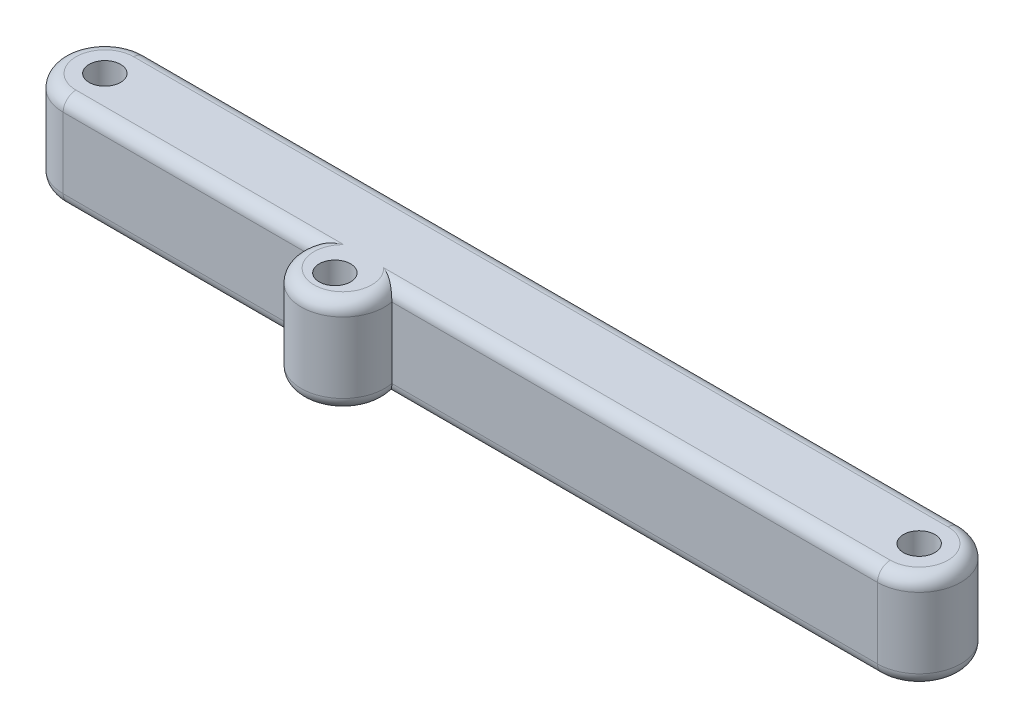
ISO-10303-21;
HEADER;
FILE_DESCRIPTION(('STEP AP214'),'2;1');
FILE_NAME('part.step','',(''),(''),'','','');
FILE_SCHEMA(('AUTOMOTIVE_DESIGN { 1 0 10303 214 1 1 1 1 }'));
ENDSEC;
DATA;
#1=APPLICATION_CONTEXT('core data for automotive mechanical design processes');
#2=APPLICATION_PROTOCOL_DEFINITION('international standard','automotive_design',2000,#1);
#3=PRODUCT_CONTEXT('',#1,'mechanical');
#4=PRODUCT('Part','Part','',(#3));
#5=PRODUCT_RELATED_PRODUCT_CATEGORY('part','',(#4));
#6=PRODUCT_DEFINITION_FORMATION('','',#4);
#7=PRODUCT_DEFINITION_CONTEXT('part definition',#1,'design');
#8=PRODUCT_DEFINITION('design','',#6,#7);
#9=PRODUCT_DEFINITION_SHAPE('','',#8);
#10=(LENGTH_UNIT() NAMED_UNIT(*) SI_UNIT(.MILLI.,.METRE.));
#11=(NAMED_UNIT(*) PLANE_ANGLE_UNIT() SI_UNIT($,.RADIAN.));
#12=(NAMED_UNIT(*) SI_UNIT($,.STERADIAN.) SOLID_ANGLE_UNIT());
#13=UNCERTAINTY_MEASURE_WITH_UNIT(LENGTH_MEASURE(1.E-05),#10,'distance_accuracy_value','');
#14=(GEOMETRIC_REPRESENTATION_CONTEXT(3) GLOBAL_UNCERTAINTY_ASSIGNED_CONTEXT((#13)) GLOBAL_UNIT_ASSIGNED_CONTEXT((#10,
#11,#12)) REPRESENTATION_CONTEXT('',''));
#15=CARTESIAN_POINT('',(0.,0.,0.));
#16=DIRECTION('',(0.,0.,1.));
#17=DIRECTION('',(1.,0.,0.));
#18=AXIS2_PLACEMENT_3D('',#15,#16,#17);
#19=CARTESIAN_POINT('',(-80.645,19.05,8.255));
#20=DIRECTION('',(0.,0.,-1.));
#21=DIRECTION('',(-1.,0.,0.));
#22=AXIS2_PLACEMENT_3D('',#19,#20,#21);
#23=PLANE('',#22);
#24=DIRECTION('',(0.,-1.,0.));
#25=VECTOR('',#24,1.);
#26=CARTESIAN_POINT('',(-80.645,19.05,8.255));
#27=LINE('',#26,#25);
#28=CARTESIAN_POINT('',(-80.645,16.51,8.255));
#29=VERTEX_POINT('',#28);
#30=CARTESIAN_POINT('',(-80.645,2.54,8.255));
#31=VERTEX_POINT('',#30);
#32=EDGE_CURVE('E171',#29,#31,#27,.T.);
#33=ORIENTED_EDGE('',*,*,#32,.T.);
#34=DIRECTION('',(1.,0.,0.));
#35=VECTOR('',#34,1.);
#36=CARTESIAN_POINT('',(-80.645,2.54,8.255));
#37=LINE('',#36,#35);
#38=CARTESIAN_POINT('',(-31.7511480940799,2.54,8.255));
#39=VERTEX_POINT('',#38);
#40=EDGE_CURVE('E189',#31,#39,#37,.T.);
#41=ORIENTED_EDGE('',*,*,#40,.T.);
#42=DIRECTION('',(0.,1.,0.));
#43=VECTOR('',#42,1.);
#44=CARTESIAN_POINT('',(-31.7511480940799,-19.2212098019349,8.255));
#45=LINE('',#44,#43);
#46=CARTESIAN_POINT('',(-31.7511480940799,16.51,8.255));
#47=VERTEX_POINT('',#46);
#48=EDGE_CURVE('E136',#39,#47,#45,.T.);
#49=ORIENTED_EDGE('',*,*,#48,.T.);
#50=DIRECTION('',(1.,0.,0.));
#51=VECTOR('',#50,1.);
#52=CARTESIAN_POINT('',(-80.645,16.51,8.255));
#53=LINE('',#52,#51);
#54=EDGE_CURVE('E187',#47,#29,#53,.F.);
#55=ORIENTED_EDGE('',*,*,#54,.T.);
#56=EDGE_LOOP('',(#33,#41,#49,#55));
#57=FACE_BOUND('',#56,.T.);
#58=ADVANCED_FACE('F37',(#57),#23,.F.);
#59=CARTESIAN_POINT('',(-80.645,19.05,0.));
#60=DIRECTION('',(0.,1.,0.));
#61=DIRECTION('',(0.,0.,1.));
#62=AXIS2_PLACEMENT_3D('',#59,#60,#61);
#63=PLANE('',#62);
#64=DIRECTION('',(1.,0.,0.));
#65=VECTOR('',#64,1.);
#66=CARTESIAN_POINT('',(-31.7511480940799,19.05,5.715));
#67=LINE('',#66,#65);
#68=CARTESIAN_POINT('',(-80.645,19.05,5.715));
#69=VERTEX_POINT('',#68);
#70=CARTESIAN_POINT('',(-27.6030734443614,19.05,5.715));
#71=VERTEX_POINT('',#70);
#72=EDGE_CURVE('E199',#69,#71,#67,.T.);
#73=ORIENTED_EDGE('',*,*,#72,.T.);
#74=CARTESIAN_POINT('',(-23.650230322,19.05,9.8425));
#75=DIRECTION('',(0.,1.,0.));
#76=DIRECTION('',(0.,0.,1.));
#77=AXIS2_PLACEMENT_3D('',#74,#75,#76);
#78=CIRCLE('',#77,5.715);
#79=CARTESIAN_POINT('',(-19.6973871996386,19.05,5.715));
#80=VERTEX_POINT('',#79);
#81=EDGE_CURVE('E54',#71,#80,#78,.T.);
#82=ORIENTED_EDGE('',*,*,#81,.T.);
#83=DIRECTION('',(1.,0.,0.));
#84=VECTOR('',#83,1.);
#85=CARTESIAN_POINT('',(80.645,19.05,5.715));
#86=LINE('',#85,#84);
#87=CARTESIAN_POINT('',(80.645,19.05,5.715));
#88=VERTEX_POINT('',#87);
#89=EDGE_CURVE('E203',#80,#88,#86,.T.);
#90=ORIENTED_EDGE('',*,*,#89,.T.);
#91=CARTESIAN_POINT('',(80.645,19.05,0.));
#92=DIRECTION('',(0.,1.,0.));
#93=DIRECTION('',(0.,0.,1.));
#94=AXIS2_PLACEMENT_3D('',#91,#92,#93);
#95=CIRCLE('',#94,5.715);
#96=CARTESIAN_POINT('',(80.645,19.05,-5.715));
#97=VERTEX_POINT('',#96);
#98=EDGE_CURVE('E201',#88,#97,#95,.T.);
#99=ORIENTED_EDGE('',*,*,#98,.T.);
#100=DIRECTION('',(-1.,0.,0.));
#101=VECTOR('',#100,1.);
#102=CARTESIAN_POINT('',(-80.645,19.05,-5.715));
#103=LINE('',#102,#101);
#104=CARTESIAN_POINT('',(-80.645,19.05,-5.715));
#105=VERTEX_POINT('',#104);
#106=EDGE_CURVE('E195',#97,#105,#103,.T.);
#107=ORIENTED_EDGE('',*,*,#106,.T.);
#108=CARTESIAN_POINT('',(-80.645,19.05,0.));
#109=DIRECTION('',(0.,1.,0.));
#110=DIRECTION('',(0.,0.,1.));
#111=AXIS2_PLACEMENT_3D('',#108,#109,#110);
#112=CIRCLE('',#111,5.715);
#113=EDGE_CURVE('E197',#105,#69,#112,.T.);
#114=ORIENTED_EDGE('',*,*,#113,.T.);
#115=EDGE_LOOP('',(#73,#82,#90,#99,#107,#114));
#116=FACE_BOUND('',#115,.T.);
#117=CARTESIAN_POINT('',(-80.645,19.05,0.));
#118=DIRECTION('',(0.,1.,0.));
#119=DIRECTION('',(0.,0.,1.));
#120=AXIS2_PLACEMENT_3D('',#117,#118,#119);
#121=CIRCLE('',#120,3.1115);
#122=CARTESIAN_POINT('',(-80.645,19.05,3.1115));
#123=VERTEX_POINT('',#122);
#124=EDGE_CURVE('E319',#123,#123,#121,.T.);
#125=ORIENTED_EDGE('',*,*,#124,.F.);
#126=EDGE_LOOP('',(#125));
#127=FACE_BOUND('',#126,.T.);
#128=CARTESIAN_POINT('',(80.645,19.05,0.));
#129=DIRECTION('',(0.,1.,0.));
#130=DIRECTION('',(0.,0.,1.));
#131=AXIS2_PLACEMENT_3D('',#128,#129,#130);
#132=CIRCLE('',#131,3.1115);
#133=CARTESIAN_POINT('',(80.645,19.05,3.1115));
#134=VERTEX_POINT('',#133);
#135=EDGE_CURVE('E343',#134,#134,#132,.T.);
#136=ORIENTED_EDGE('',*,*,#135,.F.);
#137=EDGE_LOOP('',(#136));
#138=FACE_BOUND('',#137,.T.);
#139=CARTESIAN_POINT('',(-23.650230322,19.05,11.43));
#140=DIRECTION('',(0.,1.,0.));
#141=DIRECTION('',(0.,0.,1.));
#142=AXIS2_PLACEMENT_3D('',#139,#140,#141);
#143=CIRCLE('',#142,3.1115);
#144=CARTESIAN_POINT('',(-23.650230322,19.05,14.5415));
#145=VERTEX_POINT('',#144);
#146=EDGE_CURVE('E152',#145,#145,#143,.T.);
#147=ORIENTED_EDGE('',*,*,#146,.F.);
#148=EDGE_LOOP('',(#147));
#149=FACE_BOUND('',#148,.T.);
#150=ADVANCED_FACE('F284',(#116,#127,#138,#149),#63,.T.);
#151=CARTESIAN_POINT('',(-80.645,0.,0.));
#152=DIRECTION('',(0.,1.,0.));
#153=DIRECTION('',(0.,0.,1.));
#154=AXIS2_PLACEMENT_3D('',#151,#152,#153);
#155=PLANE('',#154);
#156=DIRECTION('',(1.,0.,0.));
#157=VECTOR('',#156,1.);
#158=CARTESIAN_POINT('',(-80.645,0.,5.715));
#159=LINE('',#158,#157);
#160=CARTESIAN_POINT('',(80.645,0.,5.715));
#161=VERTEX_POINT('',#160);
#162=CARTESIAN_POINT('',(-19.6973871996386,0.,5.715));
#163=VERTEX_POINT('',#162);
#164=EDGE_CURVE('E180',#161,#163,#159,.F.);
#165=ORIENTED_EDGE('',*,*,#164,.T.);
#166=CARTESIAN_POINT('',(-23.650230322,0.,9.8425));
#167=DIRECTION('',(0.,1.,0.));
#168=DIRECTION('',(0.,0.,1.));
#169=AXIS2_PLACEMENT_3D('',#166,#167,#168);
#170=CIRCLE('',#169,5.715);
#171=CARTESIAN_POINT('',(-27.6030734443614,0.,5.715));
#172=VERTEX_POINT('',#171);
#173=EDGE_CURVE('E157',#163,#172,#170,.F.);
#174=ORIENTED_EDGE('',*,*,#173,.T.);
#175=DIRECTION('',(1.,0.,0.));
#176=VECTOR('',#175,1.);
#177=CARTESIAN_POINT('',(-80.645,0.,5.715));
#178=LINE('',#177,#176);
#179=CARTESIAN_POINT('',(-80.645,0.,5.715));
#180=VERTEX_POINT('',#179);
#181=EDGE_CURVE('E176',#172,#180,#178,.F.);
#182=ORIENTED_EDGE('',*,*,#181,.T.);
#183=CARTESIAN_POINT('',(-80.645,0.,0.));
#184=DIRECTION('',(0.,1.,0.));
#185=DIRECTION('',(0.,0.,1.));
#186=AXIS2_PLACEMENT_3D('',#183,#184,#185);
#187=CIRCLE('',#186,5.715);
#188=CARTESIAN_POINT('',(-80.645,0.,-5.715));
#189=VERTEX_POINT('',#188);
#190=EDGE_CURVE('E169',#180,#189,#187,.F.);
#191=ORIENTED_EDGE('',*,*,#190,.T.);
#192=DIRECTION('',(-1.,0.,0.));
#193=VECTOR('',#192,1.);
#194=CARTESIAN_POINT('',(-80.645,0.,-5.715));
#195=LINE('',#194,#193);
#196=CARTESIAN_POINT('',(80.645,0.,-5.715));
#197=VERTEX_POINT('',#196);
#198=EDGE_CURVE('E167',#189,#197,#195,.F.);
#199=ORIENTED_EDGE('',*,*,#198,.T.);
#200=CARTESIAN_POINT('',(80.645,0.,0.));
#201=DIRECTION('',(0.,1.,0.));
#202=DIRECTION('',(0.,0.,1.));
#203=AXIS2_PLACEMENT_3D('',#200,#201,#202);
#204=CIRCLE('',#203,5.715);
#205=EDGE_CURVE('E178',#197,#161,#204,.F.);
#206=ORIENTED_EDGE('',*,*,#205,.T.);
#207=EDGE_LOOP('',(#165,#174,#182,#191,#199,#206));
#208=FACE_BOUND('',#207,.T.);
#209=CARTESIAN_POINT('',(-80.645,0.,0.));
#210=DIRECTION('',(0.,1.,0.));
#211=DIRECTION('',(0.,0.,1.));
#212=AXIS2_PLACEMENT_3D('',#209,#210,#211);
#213=CIRCLE('',#212,3.1115);
#214=CARTESIAN_POINT('',(-80.645,0.,3.1115));
#215=VERTEX_POINT('',#214);
#216=EDGE_CURVE('E340',#215,#215,#213,.T.);
#217=ORIENTED_EDGE('',*,*,#216,.T.);
#218=EDGE_LOOP('',(#217));
#219=FACE_BOUND('',#218,.T.);
#220=CARTESIAN_POINT('',(80.645,0.,0.));
#221=DIRECTION('',(0.,1.,0.));
#222=DIRECTION('',(0.,0.,1.));
#223=AXIS2_PLACEMENT_3D('',#220,#221,#222);
#224=CIRCLE('',#223,3.1115);
#225=CARTESIAN_POINT('',(80.645,0.,3.1115));
#226=VERTEX_POINT('',#225);
#227=EDGE_CURVE('E346',#226,#226,#224,.T.);
#228=ORIENTED_EDGE('',*,*,#227,.T.);
#229=EDGE_LOOP('',(#228));
#230=FACE_BOUND('',#229,.T.);
#231=CARTESIAN_POINT('',(-23.650230322,0.,11.43));
#232=DIRECTION('',(0.,1.,0.));
#233=DIRECTION('',(0.,0.,1.));
#234=AXIS2_PLACEMENT_3D('',#231,#232,#233);
#235=CIRCLE('',#234,3.1115);
#236=CARTESIAN_POINT('',(-23.650230322,0.,14.5415));
#237=VERTEX_POINT('',#236);
#238=EDGE_CURVE('E349',#237,#237,#235,.F.);
#239=ORIENTED_EDGE('',*,*,#238,.F.);
#240=EDGE_LOOP('',(#239));
#241=FACE_BOUND('',#240,.T.);
#242=ADVANCED_FACE('F291',(#208,#219,#230,#241),#155,.F.);
#243=CARTESIAN_POINT('',(-80.645,19.05,0.));
#244=DIRECTION('',(0.,-1.,0.));
#245=DIRECTION('',(0.,0.,-1.));
#246=AXIS2_PLACEMENT_3D('',#243,#244,#245);
#247=CYLINDRICAL_SURFACE('',#246,8.255);
#248=DIRECTION('',(0.,-1.,0.));
#249=VECTOR('',#248,1.);
#250=CARTESIAN_POINT('',(-80.645,19.05,-8.255));
#251=LINE('',#250,#249);
#252=CARTESIAN_POINT('',(-80.645,16.51,-8.255));
#253=VERTEX_POINT('',#252);
#254=CARTESIAN_POINT('',(-80.645,2.54000000000001,-8.255));
#255=VERTEX_POINT('',#254);
#256=EDGE_CURVE('E312',#253,#255,#251,.T.);
#257=ORIENTED_EDGE('',*,*,#256,.T.);
#258=CARTESIAN_POINT('',(-80.645,2.54,0.));
#259=DIRECTION('',(0.,1.,0.));
#260=DIRECTION('',(0.,0.,1.));
#261=AXIS2_PLACEMENT_3D('',#258,#259,#260);
#262=CIRCLE('',#261,8.255);
#263=EDGE_CURVE('E193',#255,#31,#262,.T.);
#264=ORIENTED_EDGE('',*,*,#263,.T.);
#265=ORIENTED_EDGE('',*,*,#32,.F.);
#266=CARTESIAN_POINT('',(-80.645,16.51,0.));
#267=DIRECTION('',(0.,1.,0.));
#268=DIRECTION('',(0.,0.,1.));
#269=AXIS2_PLACEMENT_3D('',#266,#267,#268);
#270=CIRCLE('',#269,8.255);
#271=EDGE_CURVE('E191',#29,#253,#270,.F.);
#272=ORIENTED_EDGE('',*,*,#271,.T.);
#273=EDGE_LOOP('',(#257,#264,#265,#272));
#274=FACE_BOUND('',#273,.T.);
#275=ADVANCED_FACE('F297',(#274),#247,.T.);
#276=DIRECTION('',(0.,1.,0.));
#277=VECTOR('',#276,1.);
#278=CARTESIAN_POINT('',(-15.5493125499201,-19.2212098019349,8.255));
#279=LINE('',#278,#277);
#280=CARTESIAN_POINT('',(-15.5493125499201,2.54,8.255));
#281=VERTEX_POINT('',#280);
#282=CARTESIAN_POINT('',(-15.5493125499201,16.51,8.255));
#283=VERTEX_POINT('',#282);
#284=EDGE_CURVE('E134',#281,#283,#279,.T.);
#285=ORIENTED_EDGE('',*,*,#284,.F.);
#286=DIRECTION('',(1.,0.,0.));
#287=VECTOR('',#286,1.);
#288=CARTESIAN_POINT('',(-80.645,2.54,8.255));
#289=LINE('',#288,#287);
#290=CARTESIAN_POINT('',(80.645,2.54,8.255));
#291=VERTEX_POINT('',#290);
#292=EDGE_CURVE('E149',#281,#291,#289,.T.);
#293=ORIENTED_EDGE('',*,*,#292,.T.);
#294=DIRECTION('',(0.,-1.,0.));
#295=VECTOR('',#294,1.);
#296=CARTESIAN_POINT('',(80.645,19.05,8.255));
#297=LINE('',#296,#295);
#298=CARTESIAN_POINT('',(80.645,16.51,8.255));
#299=VERTEX_POINT('',#298);
#300=EDGE_CURVE('E335',#299,#291,#297,.T.);
#301=ORIENTED_EDGE('',*,*,#300,.F.);
#302=DIRECTION('',(1.,0.,0.));
#303=VECTOR('',#302,1.);
#304=CARTESIAN_POINT('',(-15.5493125499201,16.51,8.255));
#305=LINE('',#304,#303);
#306=EDGE_CURVE('E151',#299,#283,#305,.F.);
#307=ORIENTED_EDGE('',*,*,#306,.T.);
#308=EDGE_LOOP('',(#285,#293,#301,#307));
#309=FACE_BOUND('',#308,.T.);
#310=ADVANCED_FACE('F146',(#309),#23,.F.);
#311=CARTESIAN_POINT('',(80.645,19.05,0.));
#312=DIRECTION('',(0.,-1.,0.));
#313=DIRECTION('',(0.,0.,-1.));
#314=AXIS2_PLACEMENT_3D('',#311,#312,#313);
#315=CYLINDRICAL_SURFACE('',#314,8.255);
#316=ORIENTED_EDGE('',*,*,#300,.T.);
#317=CARTESIAN_POINT('',(80.645,2.54,0.));
#318=DIRECTION('',(0.,1.,0.));
#319=DIRECTION('',(0.,0.,1.));
#320=AXIS2_PLACEMENT_3D('',#317,#318,#319);
#321=CIRCLE('',#320,8.255);
#322=CARTESIAN_POINT('',(80.645,2.54000000000001,-8.255));
#323=VERTEX_POINT('',#322);
#324=EDGE_CURVE('E185',#291,#323,#321,.T.);
#325=ORIENTED_EDGE('',*,*,#324,.T.);
#326=DIRECTION('',(0.,-1.,0.));
#327=VECTOR('',#326,1.);
#328=CARTESIAN_POINT('',(80.645,19.05,-8.255));
#329=LINE('',#328,#327);
#330=CARTESIAN_POINT('',(80.645,16.51,-8.255));
#331=VERTEX_POINT('',#330);
#332=EDGE_CURVE('E318',#331,#323,#329,.T.);
#333=ORIENTED_EDGE('',*,*,#332,.F.);
#334=CARTESIAN_POINT('',(80.645,16.51,0.));
#335=DIRECTION('',(0.,1.,0.));
#336=DIRECTION('',(0.,0.,1.));
#337=AXIS2_PLACEMENT_3D('',#334,#335,#336);
#338=CIRCLE('',#337,8.255);
#339=EDGE_CURVE('E183',#331,#299,#338,.F.);
#340=ORIENTED_EDGE('',*,*,#339,.T.);
#341=EDGE_LOOP('',(#316,#325,#333,#340));
#342=FACE_BOUND('',#341,.T.);
#343=ADVANCED_FACE('F296',(#342),#315,.T.);
#344=CARTESIAN_POINT('',(-80.645,19.05,-8.255));
#345=DIRECTION('',(0.,0.,1.));
#346=DIRECTION('',(1.,0.,0.));
#347=AXIS2_PLACEMENT_3D('',#344,#345,#346);
#348=PLANE('',#347);
#349=ORIENTED_EDGE('',*,*,#332,.T.);
#350=DIRECTION('',(-1.,0.,0.));
#351=VECTOR('',#350,1.);
#352=CARTESIAN_POINT('',(-80.645,2.54,-8.255));
#353=LINE('',#352,#351);
#354=EDGE_CURVE('E12',#323,#255,#353,.T.);
#355=ORIENTED_EDGE('',*,*,#354,.T.);
#356=ORIENTED_EDGE('',*,*,#256,.F.);
#357=DIRECTION('',(-1.,0.,0.));
#358=VECTOR('',#357,1.);
#359=CARTESIAN_POINT('',(80.645,16.51,-8.255));
#360=LINE('',#359,#358);
#361=EDGE_CURVE('E46',#253,#331,#360,.F.);
#362=ORIENTED_EDGE('',*,*,#361,.T.);
#363=EDGE_LOOP('',(#349,#355,#356,#362));
#364=FACE_BOUND('',#363,.T.);
#365=ADVANCED_FACE('F302',(#364),#348,.F.);
#366=CARTESIAN_POINT('',(-80.645,19.05,0.));
#367=DIRECTION('',(0.,-1.,0.));
#368=DIRECTION('',(0.,0.,-1.));
#369=AXIS2_PLACEMENT_3D('',#366,#367,#368);
#370=CYLINDRICAL_SURFACE('',#369,3.1115);
#371=ORIENTED_EDGE('',*,*,#124,.T.);
#372=EDGE_LOOP('',(#371));
#373=FACE_BOUND('',#372,.T.);
#374=ORIENTED_EDGE('',*,*,#216,.F.);
#375=EDGE_LOOP('',(#374));
#376=FACE_BOUND('',#375,.T.);
#377=ADVANCED_FACE('F371',(#373,#376),#370,.F.);
#378=CARTESIAN_POINT('',(80.645,19.05,0.));
#379=DIRECTION('',(0.,-1.,0.));
#380=DIRECTION('',(0.,0.,-1.));
#381=AXIS2_PLACEMENT_3D('',#378,#379,#380);
#382=CYLINDRICAL_SURFACE('',#381,3.1115);
#383=ORIENTED_EDGE('',*,*,#135,.T.);
#384=EDGE_LOOP('',(#383));
#385=FACE_BOUND('',#384,.T.);
#386=ORIENTED_EDGE('',*,*,#227,.F.);
#387=EDGE_LOOP('',(#386));
#388=FACE_BOUND('',#387,.T.);
#389=ADVANCED_FACE('F362',(#385,#388),#382,.F.);
#390=CARTESIAN_POINT('',(-23.650230322,-19.2212098019349,11.43));
#391=DIRECTION('',(0.,1.,0.));
#392=DIRECTION('',(0.,0.,1.));
#393=AXIS2_PLACEMENT_3D('',#390,#391,#392);
#394=CYLINDRICAL_SURFACE('',#393,3.1115);
#395=ORIENTED_EDGE('',*,*,#238,.T.);
#396=EDGE_LOOP('',(#395));
#397=FACE_BOUND('',#396,.T.);
#398=ORIENTED_EDGE('',*,*,#146,.T.);
#399=EDGE_LOOP('',(#398));
#400=FACE_BOUND('',#399,.T.);
#401=ADVANCED_FACE('F358',(#397,#400),#394,.F.);
#402=CARTESIAN_POINT('',(-23.650230322,-19.2212098019349,9.8425));
#403=DIRECTION('',(0.,1.,0.));
#404=DIRECTION('',(0.,0.,1.));
#405=AXIS2_PLACEMENT_3D('',#402,#403,#404);
#406=CYLINDRICAL_SURFACE('',#405,8.255);
#407=ORIENTED_EDGE('',*,*,#48,.F.);
#408=CARTESIAN_POINT('',(-23.650230322,2.54,9.8425));
#409=DIRECTION('',(0.,1.,0.));
#410=DIRECTION('',(0.,0.,1.));
#411=AXIS2_PLACEMENT_3D('',#408,#409,#410);
#412=CIRCLE('',#411,8.255);
#413=EDGE_CURVE('E131',#39,#281,#412,.T.);
#414=ORIENTED_EDGE('',*,*,#413,.T.);
#415=ORIENTED_EDGE('',*,*,#284,.T.);
#416=CARTESIAN_POINT('',(-23.650230322,16.51,9.8425));
#417=DIRECTION('',(0.,1.,0.));
#418=DIRECTION('',(0.,0.,1.));
#419=AXIS2_PLACEMENT_3D('',#416,#417,#418);
#420=CIRCLE('',#419,8.255);
#421=EDGE_CURVE('E141',#283,#47,#420,.F.);
#422=ORIENTED_EDGE('',*,*,#421,.T.);
#423=EDGE_LOOP('',(#407,#414,#415,#422));
#424=FACE_BOUND('',#423,.T.);
#425=ADVANCED_FACE('F133',(#424),#406,.T.);
#426=CARTESIAN_POINT('',(-80.645,2.54,0.));
#427=DIRECTION('',(0.,1.,0.));
#428=DIRECTION('',(0.,0.,1.));
#429=AXIS2_PLACEMENT_3D('',#426,#427,#428);
#430=TOROIDAL_SURFACE('',#429,5.715,2.54);
#431=CARTESIAN_POINT('',(-80.645,2.54,-5.715));
#432=DIRECTION('',(1.,0.,0.));
#433=DIRECTION('',(0.,0.,-1.));
#434=AXIS2_PLACEMENT_3D('',#431,#432,#433);
#435=CIRCLE('',#434,2.54);
#436=EDGE_CURVE('E239',#189,#255,#435,.T.);
#437=ORIENTED_EDGE('',*,*,#436,.F.);
#438=ORIENTED_EDGE('',*,*,#190,.F.);
#439=CARTESIAN_POINT('',(-80.645,2.54,5.715));
#440=DIRECTION('',(1.,0.,0.));
#441=DIRECTION('',(0.,0.,-1.));
#442=AXIS2_PLACEMENT_3D('',#439,#440,#441);
#443=CIRCLE('',#442,2.54);
#444=EDGE_CURVE('E242',#31,#180,#443,.T.);
#445=ORIENTED_EDGE('',*,*,#444,.F.);
#446=ORIENTED_EDGE('',*,*,#263,.F.);
#447=EDGE_LOOP('',(#437,#438,#445,#446));
#448=FACE_BOUND('',#447,.T.);
#449=ADVANCED_FACE('F230',(#448),#430,.T.);
#450=CARTESIAN_POINT('',(-80.645,2.54,5.715));
#451=DIRECTION('',(1.,0.,0.));
#452=DIRECTION('',(0.,0.,-1.));
#453=AXIS2_PLACEMENT_3D('',#450,#451,#452);
#454=CYLINDRICAL_SURFACE('',#453,2.54);
#455=ORIENTED_EDGE('',*,*,#444,.T.);
#456=ORIENTED_EDGE('',*,*,#181,.F.);
#457=CARTESIAN_POINT('',(-31.7511480940799,2.54,8.255));
#458=CARTESIAN_POINT('',(-31.7511626806876,2.48726818391755,8.25501447126351));
#459=CARTESIAN_POINT('',(-31.7491534964104,2.43454768738916,8.25335838738263));
#460=CARTESIAN_POINT('',(-31.7412005070636,2.3296516083833,8.24681616110304));
#461=CARTESIAN_POINT('',(-31.7352601820549,2.27747558536776,8.24193287560504));
#462=CARTESIAN_POINT('',(-31.7196319868549,2.17458640685958,8.22910808999172));
#463=CARTESIAN_POINT('',(-31.7099802203622,2.12386406718013,8.22119605580243));
#464=CARTESIAN_POINT('',(-31.6871284650519,2.02377285495108,8.2025098919383));
#465=CARTESIAN_POINT('',(-31.6739279086478,1.97440420030029,8.19173530443558));
#466=CARTESIAN_POINT('',(-31.6294436073153,1.82917287709911,8.15553828609822));
#467=CARTESIAN_POINT('',(-31.5932078338531,1.73574658503974,8.12618500893064));
#468=CARTESIAN_POINT('',(-31.5096338778113,1.55715726204263,8.05909496105212));
#469=CARTESIAN_POINT('',(-31.462268307315,1.47201535997204,8.02133752188409));
#470=CARTESIAN_POINT('',(-31.3359378409666,1.27558201783385,7.92173718981459));
#471=CARTESIAN_POINT('',(-31.252195957964,1.16905621935518,7.85656721810868));
#472=CARTESIAN_POINT('',(-31.0712339940629,0.974083645215625,7.71846025876319));
#473=CARTESIAN_POINT('',(-30.973987813849,0.885672718943901,7.64550829598718));
#474=CARTESIAN_POINT('',(-30.7931042757951,0.743697209486193,7.5127878240564));
#475=CARTESIAN_POINT('',(-30.7114443917818,0.686788116200881,7.45382218967876));
#476=CARTESIAN_POINT('',(-30.5433940230948,0.581812043998808,7.3346940401329));
#477=CARTESIAN_POINT('',(-30.4570008985705,0.53375006585058,7.2745308692247));
#478=CARTESIAN_POINT('',(-30.2803006998734,0.445552253055612,7.15391515088838));
#479=CARTESIAN_POINT('',(-30.1899886666618,0.405426840524384,7.09346232833839));
#480=CARTESIAN_POINT('',(-30.0061867525524,0.332316818940821,6.9730523923948));
#481=CARTESIAN_POINT('',(-29.9126959609621,0.299334276559859,6.91309542728265));
#482=CARTESIAN_POINT('',(-29.6951741875395,0.230973148580989,6.77678978759821));
#483=CARTESIAN_POINT('',(-29.5702435274507,0.197739730332701,6.70080297592103));
#484=CARTESIAN_POINT('',(-29.316706655109,0.140387963961419,6.55157103496919));
#485=CARTESIAN_POINT('',(-29.1880994614577,0.116272074537634,6.47832665002805));
#486=CARTESIAN_POINT('',(-28.9279229177263,0.0758083233833928,6.33537923335838));
#487=CARTESIAN_POINT('',(-28.7963566629056,0.0594527069614442,6.26567272878066));
#488=CARTESIAN_POINT('',(-28.5305362808119,0.0332294059672918,6.13027773227731));
#489=CARTESIAN_POINT('',(-28.3962817355838,0.0233627384464696,6.0645898716802));
#490=CARTESIAN_POINT('',(-28.0858727721482,0.0068766388909572,5.91918389554379));
#491=CARTESIAN_POINT('',(-27.908917319927,0.00204337310118264,5.84096085353623));
#492=CARTESIAN_POINT('',(-27.6916943952666,0.000203702497455917,5.75091431475574));
#493=CARTESIAN_POINT('',(-27.6530461687369,3.18065321381454E-05,5.7351201869262));
#494=CARTESIAN_POINT('',(-27.6105705923706,1.33780698486761E-06,5.71801307003382));
#495=CARTESIAN_POINT('',(-27.6068223927488,-9.62763687811806E-10,5.71650561501602));
#496=CARTESIAN_POINT('',(-27.6030734443614,0.,5.715));
#497=B_SPLINE_CURVE_WITH_KNOTS('',3,(#457,#458,#459,#460,#461,#462,#463,#464,#465,#466,#467,
#468,#469,#470,#471,#472,#473,#474,#475,#476,#477,#478,#479,#480,#481,#482,#483,#484,#485,#486,
#487,#488,#489,#490,#491,#492,#493,#494,#495,#496),.UNSPECIFIED.,.F.,.F.,(4,2,2,2,2,2,2,2,2,2,2,
2,2,2,2,2,2,2,2,4),(0.,0.158112841081583,0.316085898927085,0.472559607947806,0.62905835796882,
0.940732428452564,1.25318164232427,1.70173977874308,2.15117721703047,2.49777770555003,
2.84457350992894,3.19182173843384,3.53917030363834,3.98861328899242,4.4381773881123,
4.88729129537264,5.33647557814938,5.91665717279632,6.04191091324881,6.05403084734952),.UNSPECIFIED.);
#498=EDGE_CURVE('E233',#39,#172,#497,.T.);
#499=ORIENTED_EDGE('',*,*,#498,.F.);
#500=ORIENTED_EDGE('',*,*,#40,.F.);
#501=EDGE_LOOP('',(#455,#456,#499,#500));
#502=FACE_BOUND('',#501,.T.);
#503=ADVANCED_FACE('F225',(#502),#454,.T.);
#504=CARTESIAN_POINT('',(-80.645,2.54,-5.715));
#505=DIRECTION('',(-1.,0.,0.));
#506=DIRECTION('',(0.,0.,1.));
#507=AXIS2_PLACEMENT_3D('',#504,#505,#506);
#508=CYLINDRICAL_SURFACE('',#507,2.54);
#509=ORIENTED_EDGE('',*,*,#436,.T.);
#510=ORIENTED_EDGE('',*,*,#354,.F.);
#511=CARTESIAN_POINT('',(80.645,2.54,-5.715));
#512=DIRECTION('',(1.,0.,0.));
#513=DIRECTION('',(0.,0.,-1.));
#514=AXIS2_PLACEMENT_3D('',#511,#512,#513);
#515=CIRCLE('',#514,2.54);
#516=EDGE_CURVE('E161',#197,#323,#515,.T.);
#517=ORIENTED_EDGE('',*,*,#516,.F.);
#518=ORIENTED_EDGE('',*,*,#198,.F.);
#519=EDGE_LOOP('',(#509,#510,#517,#518));
#520=FACE_BOUND('',#519,.T.);
#521=ADVANCED_FACE('F229',(#520),#508,.T.);
#522=CARTESIAN_POINT('',(-23.650230322,2.54,9.8425));
#523=DIRECTION('',(0.,1.,0.));
#524=DIRECTION('',(0.,0.,1.));
#525=AXIS2_PLACEMENT_3D('',#522,#523,#524);
#526=TOROIDAL_SURFACE('',#525,5.715,2.54);
#527=ORIENTED_EDGE('',*,*,#498,.T.);
#528=ORIENTED_EDGE('',*,*,#173,.F.);
#529=CARTESIAN_POINT('',(-15.5493125499201,2.54,8.255));
#530=CARTESIAN_POINT('',(-15.5492979633125,2.48726818391755,8.25501447126351));
#531=CARTESIAN_POINT('',(-15.5513071475896,2.43454768738916,8.25335838738263));
#532=CARTESIAN_POINT('',(-15.5592601369364,2.3296516083833,8.24681616110304));
#533=CARTESIAN_POINT('',(-15.5652004619451,2.27747558536776,8.24193287560504));
#534=CARTESIAN_POINT('',(-15.5808286571451,2.17458640685958,8.22910808999172));
#535=CARTESIAN_POINT('',(-15.5904804236378,2.12386406718013,8.22119605580243));
#536=CARTESIAN_POINT('',(-15.6133321789481,2.02377285495107,8.2025098919383));
#537=CARTESIAN_POINT('',(-15.6265327353522,1.97440420030029,8.19173530443558));
#538=CARTESIAN_POINT('',(-15.6710170366847,1.82917287709911,8.15553828609822));
#539=CARTESIAN_POINT('',(-15.7072528101469,1.73574658503974,8.12618500893064));
#540=CARTESIAN_POINT('',(-15.7908267661887,1.55715726204263,8.05909496105213));
#541=CARTESIAN_POINT('',(-15.838192336685,1.47201535997204,8.0213375218841));
#542=CARTESIAN_POINT('',(-15.9645228030334,1.27558201783386,7.9217371898146));
#543=CARTESIAN_POINT('',(-16.048264686036,1.16905621935518,7.85656721810868));
#544=CARTESIAN_POINT('',(-16.2292266499371,0.974083645215627,7.71846025876319));
#545=CARTESIAN_POINT('',(-16.326472830151,0.885672718943904,7.64550829598719));
#546=CARTESIAN_POINT('',(-16.5073563682049,0.743697209486194,7.5127878240564));
#547=CARTESIAN_POINT('',(-16.5890162522182,0.686788116200881,7.45382218967876));
#548=CARTESIAN_POINT('',(-16.7570666209052,0.581812043998805,7.33469404013289));
#549=CARTESIAN_POINT('',(-16.8434597454295,0.533750065850576,7.2745308692247));
#550=CARTESIAN_POINT('',(-17.0201599441266,0.44555225305561,7.15391515088837));
#551=CARTESIAN_POINT('',(-17.1104719773382,0.405426840524384,7.09346232833839));
#552=CARTESIAN_POINT('',(-17.2942738914476,0.332316818940822,6.9730523923948));
#553=CARTESIAN_POINT('',(-17.3877646830379,0.29933427655986,6.91309542728266));
#554=CARTESIAN_POINT('',(-17.6052864564605,0.230973148580992,6.77678978759822));
#555=CARTESIAN_POINT('',(-17.7302171165492,0.197739730332707,6.70080297592104));
#556=CARTESIAN_POINT('',(-17.983753988891,0.140387963961427,6.55157103496922));
#557=CARTESIAN_POINT('',(-18.1123611825422,0.116272074537643,6.47832665002809));
#558=CARTESIAN_POINT('',(-18.3725377262736,0.0758083233834008,6.3353792333584));
#559=CARTESIAN_POINT('',(-18.5041039810944,0.0594527069614506,6.26567272878064));
#560=CARTESIAN_POINT('',(-18.7699243631881,0.0332294059672942,6.13027773227737));
#561=CARTESIAN_POINT('',(-18.9041789084163,0.0233627384464702,6.06458987168037));
#562=CARTESIAN_POINT('',(-19.2145878718517,0.00687663889095754,5.91918389554357));
#563=CARTESIAN_POINT('',(-19.3915433240726,0.00204337310118421,5.84096085353531));
#564=CARTESIAN_POINT('',(-19.6087662487335,0.000203702497455667,5.75091431475594));
#565=CARTESIAN_POINT('',(-19.6474144752633,3.18065321374488E-05,5.73512018692667));
#566=CARTESIAN_POINT('',(-19.6898900516295,1.3378069847403E-06,5.71801307003391));
#567=CARTESIAN_POINT('',(-19.6936382512512,-9.62763755964974E-10,5.71650561501607));
#568=CARTESIAN_POINT('',(-19.6973871996386,0.,5.715));
#569=B_SPLINE_CURVE_WITH_KNOTS('',3,(#529,#530,#531,#532,#533,#534,#535,#536,#537,#538,#539,
#540,#541,#542,#543,#544,#545,#546,#547,#548,#549,#550,#551,#552,#553,#554,#555,#556,#557,#558,
#559,#560,#561,#562,#563,#564,#565,#566,#567,#568),.UNSPECIFIED.,.F.,.F.,(4,2,2,2,2,2,2,2,2,2,2,
2,2,2,2,2,2,2,2,4),(0.,0.158112841081584,0.316085898927085,0.472559607947805,0.629058357968819,
0.940732428452562,1.25318164232427,1.70173977874308,2.15117721703046,2.49777770555003,
2.84457350992894,3.19182173843385,3.53917030363833,3.98861328899239,4.43817738811223,
4.88729129537258,5.33647557814938,5.91665717279632,6.04191091324882,6.05403084734952),.UNSPECIFIED.);
#570=EDGE_CURVE('E155',#281,#163,#569,.T.);
#571=ORIENTED_EDGE('',*,*,#570,.F.);
#572=ORIENTED_EDGE('',*,*,#413,.F.);
#573=EDGE_LOOP('',(#527,#528,#571,#572));
#574=FACE_BOUND('',#573,.T.);
#575=ADVANCED_FACE('F156',(#574),#526,.T.);
#576=CARTESIAN_POINT('',(80.645,2.54,0.));
#577=DIRECTION('',(0.,1.,0.));
#578=DIRECTION('',(0.,0.,1.));
#579=AXIS2_PLACEMENT_3D('',#576,#577,#578);
#580=TOROIDAL_SURFACE('',#579,5.715,2.54);
#581=ORIENTED_EDGE('',*,*,#516,.T.);
#582=ORIENTED_EDGE('',*,*,#324,.F.);
#583=CARTESIAN_POINT('',(80.645,2.54,5.715));
#584=DIRECTION('',(-1.,0.,0.));
#585=DIRECTION('',(0.,0.,1.));
#586=AXIS2_PLACEMENT_3D('',#583,#584,#585);
#587=CIRCLE('',#586,2.54);
#588=EDGE_CURVE('E162',#161,#291,#587,.T.);
#589=ORIENTED_EDGE('',*,*,#588,.F.);
#590=ORIENTED_EDGE('',*,*,#205,.F.);
#591=EDGE_LOOP('',(#581,#582,#589,#590));
#592=FACE_BOUND('',#591,.T.);
#593=ADVANCED_FACE('F221',(#592),#580,.T.);
#594=CARTESIAN_POINT('',(-80.645,2.54,5.715));
#595=DIRECTION('',(1.,0.,0.));
#596=DIRECTION('',(0.,0.,-1.));
#597=AXIS2_PLACEMENT_3D('',#594,#595,#596);
#598=CYLINDRICAL_SURFACE('',#597,2.54);
#599=ORIENTED_EDGE('',*,*,#570,.T.);
#600=ORIENTED_EDGE('',*,*,#164,.F.);
#601=ORIENTED_EDGE('',*,*,#588,.T.);
#602=ORIENTED_EDGE('',*,*,#292,.F.);
#603=EDGE_LOOP('',(#599,#600,#601,#602));
#604=FACE_BOUND('',#603,.T.);
#605=ADVANCED_FACE('F164',(#604),#598,.T.);
#606=CARTESIAN_POINT('',(-80.645,16.51,0.));
#607=DIRECTION('',(0.,1.,0.));
#608=DIRECTION('',(0.,0.,1.));
#609=AXIS2_PLACEMENT_3D('',#606,#607,#608);
#610=TOROIDAL_SURFACE('',#609,5.715,2.54);
#611=CARTESIAN_POINT('',(-80.645,16.51,-5.715));
#612=DIRECTION('',(1.,0.,0.));
#613=DIRECTION('',(0.,0.,-1.));
#614=AXIS2_PLACEMENT_3D('',#611,#612,#613);
#615=CIRCLE('',#614,2.54);
#616=EDGE_CURVE('E273',#253,#105,#615,.T.);
#617=ORIENTED_EDGE('',*,*,#616,.F.);
#618=ORIENTED_EDGE('',*,*,#271,.F.);
#619=CARTESIAN_POINT('',(-80.645,16.51,5.715));
#620=DIRECTION('',(1.,0.,0.));
#621=DIRECTION('',(0.,0.,-1.));
#622=AXIS2_PLACEMENT_3D('',#619,#620,#621);
#623=CIRCLE('',#622,2.54);
#624=EDGE_CURVE('E41',#69,#29,#623,.T.);
#625=ORIENTED_EDGE('',*,*,#624,.F.);
#626=ORIENTED_EDGE('',*,*,#113,.F.);
#627=EDGE_LOOP('',(#617,#618,#625,#626));
#628=FACE_BOUND('',#627,.T.);
#629=ADVANCED_FACE('F39',(#628),#610,.T.);
#630=CARTESIAN_POINT('',(-80.645,16.51,5.715));
#631=DIRECTION('',(-1.,0.,0.));
#632=DIRECTION('',(0.,0.,1.));
#633=AXIS2_PLACEMENT_3D('',#630,#631,#632);
#634=CYLINDRICAL_SURFACE('',#633,2.54);
#635=ORIENTED_EDGE('',*,*,#624,.T.);
#636=ORIENTED_EDGE('',*,*,#54,.F.);
#637=CARTESIAN_POINT('',(-31.7511480940799,16.51,8.255));
#638=CARTESIAN_POINT('',(-31.7511626806876,16.5627318160824,8.25501447126351));
#639=CARTESIAN_POINT('',(-31.7491534964104,16.6154523126108,8.25335838738263));
#640=CARTESIAN_POINT('',(-31.7412005070636,16.7203483916167,8.24681616110304));
#641=CARTESIAN_POINT('',(-31.7352601820549,16.7725244146322,8.24193287560504));
#642=CARTESIAN_POINT('',(-31.7196319868549,16.8754135931404,8.22910808999172));
#643=CARTESIAN_POINT('',(-31.7099802203622,16.9261359328199,8.22119605580243));
#644=CARTESIAN_POINT('',(-31.6871284650519,17.0262271450489,8.2025098919383));
#645=CARTESIAN_POINT('',(-31.6739279086478,17.0755957996997,8.19173530443558));
#646=CARTESIAN_POINT('',(-31.6294436073153,17.2208271229009,8.15553828609822));
#647=CARTESIAN_POINT('',(-31.5932078338531,17.3142534149603,8.12618500893064));
#648=CARTESIAN_POINT('',(-31.5096338778113,17.4928427379574,8.05909496105213));
#649=CARTESIAN_POINT('',(-31.462268307315,17.577984640028,8.0213375218841));
#650=CARTESIAN_POINT('',(-31.3359378409666,17.7744179821661,7.92173718981459));
#651=CARTESIAN_POINT('',(-31.252195957964,17.8809437806448,7.85656721810868));
#652=CARTESIAN_POINT('',(-31.0712339940629,18.0759163547844,7.71846025876319));
#653=CARTESIAN_POINT('',(-30.973987813849,18.1643272810561,7.64550829598718));
#654=CARTESIAN_POINT('',(-30.7931042757951,18.3063027905138,7.5127878240564));
#655=CARTESIAN_POINT('',(-30.7114443917818,18.3632118837991,7.45382218967875));
#656=CARTESIAN_POINT('',(-30.5433940230948,18.4681879560012,7.33469404013289));
#657=CARTESIAN_POINT('',(-30.4570008985705,18.5162499341494,7.27453086922469));
#658=CARTESIAN_POINT('',(-30.2803006998734,18.6044477469444,7.15391515088837));
#659=CARTESIAN_POINT('',(-30.1899886666618,18.6445731594756,7.09346232833838));
#660=CARTESIAN_POINT('',(-30.0061867525524,18.7176831810592,6.9730523923948));
#661=CARTESIAN_POINT('',(-29.9126959609621,18.7506657234401,6.91309542728265));
#662=CARTESIAN_POINT('',(-29.6951741875395,18.819026851419,6.77678978759821));
#663=CARTESIAN_POINT('',(-29.5702435274507,18.8522602696673,6.70080297592103));
#664=CARTESIAN_POINT('',(-29.316706655109,18.9096120360386,6.55157103496921));
#665=CARTESIAN_POINT('',(-29.1880994614578,18.9337279254624,6.47832665002808));
#666=CARTESIAN_POINT('',(-28.9279229177264,18.9741916766166,6.33537923335839));
#667=CARTESIAN_POINT('',(-28.7963566629056,18.9905472930386,6.26567272878064));
#668=CARTESIAN_POINT('',(-28.5305362808119,19.0167705940327,6.13027773227736));
#669=CARTESIAN_POINT('',(-28.3962817355837,19.0266372615535,6.06458987168037));
#670=CARTESIAN_POINT('',(-28.0858727721483,19.043123361109,5.91918389554356));
#671=CARTESIAN_POINT('',(-27.9089173199274,19.0479566268988,5.8409608535353));
#672=CARTESIAN_POINT('',(-27.6916943952665,19.0497962975025,5.75091431475594));
#673=CARTESIAN_POINT('',(-27.6530461687367,19.0499681934679,5.73512018692668));
#674=CARTESIAN_POINT('',(-27.6105705923705,19.049998662193,5.71801307003391));
#675=CARTESIAN_POINT('',(-27.6068223927488,19.0500000009628,5.71650561501607));
#676=CARTESIAN_POINT('',(-27.6030734443614,19.05,5.715));
#677=B_SPLINE_CURVE_WITH_KNOTS('',3,(#637,#638,#639,#640,#641,#642,#643,#644,#645,#646,#647,
#648,#649,#650,#651,#652,#653,#654,#655,#656,#657,#658,#659,#660,#661,#662,#663,#664,#665,#666,
#667,#668,#669,#670,#671,#672,#673,#674,#675,#676),.UNSPECIFIED.,.F.,.F.,(4,2,2,2,2,2,2,2,2,2,2,
2,2,2,2,2,2,2,2,4),(0.,0.158112841081589,0.316085898927088,0.472559607947806,0.629058357968821,
0.940732428452563,1.25318164232427,1.70173977874308,2.15117721703047,2.49777770555004,
2.84457350992896,3.19182173843386,3.53917030363835,3.98861328899241,4.43817738811224,
4.8872912953726,5.33647557814939,5.91665717279633,6.04191091324882,6.05403084734952),.UNSPECIFIED.);
#678=EDGE_CURVE('E267',#71,#47,#677,.F.);
#679=ORIENTED_EDGE('',*,*,#678,.F.);
#680=ORIENTED_EDGE('',*,*,#72,.F.);
#681=EDGE_LOOP('',(#635,#636,#679,#680));
#682=FACE_BOUND('',#681,.T.);
#683=ADVANCED_FACE('F274',(#682),#634,.T.);
#684=CARTESIAN_POINT('',(-80.645,16.51,-5.715));
#685=DIRECTION('',(1.,0.,0.));
#686=DIRECTION('',(0.,0.,-1.));
#687=AXIS2_PLACEMENT_3D('',#684,#685,#686);
#688=CYLINDRICAL_SURFACE('',#687,2.54);
#689=ORIENTED_EDGE('',*,*,#616,.T.);
#690=ORIENTED_EDGE('',*,*,#106,.F.);
#691=CARTESIAN_POINT('',(80.645,16.51,-5.715));
#692=DIRECTION('',(1.,0.,0.));
#693=DIRECTION('',(0.,0.,-1.));
#694=AXIS2_PLACEMENT_3D('',#691,#692,#693);
#695=CIRCLE('',#694,2.54);
#696=EDGE_CURVE('E254',#331,#97,#695,.T.);
#697=ORIENTED_EDGE('',*,*,#696,.F.);
#698=ORIENTED_EDGE('',*,*,#361,.F.);
#699=EDGE_LOOP('',(#689,#690,#697,#698));
#700=FACE_BOUND('',#699,.T.);
#701=ADVANCED_FACE('F263',(#700),#688,.T.);
#702=CARTESIAN_POINT('',(-23.650230322,16.51,9.8425));
#703=DIRECTION('',(0.,1.,0.));
#704=DIRECTION('',(0.,0.,1.));
#705=AXIS2_PLACEMENT_3D('',#702,#703,#704);
#706=TOROIDAL_SURFACE('',#705,5.715,2.54);
#707=ORIENTED_EDGE('',*,*,#678,.T.);
#708=ORIENTED_EDGE('',*,*,#421,.F.);
#709=CARTESIAN_POINT('',(-15.5493125499201,16.51,8.255));
#710=CARTESIAN_POINT('',(-15.5492979633125,16.5627318160824,8.25501447126351));
#711=CARTESIAN_POINT('',(-15.5513071475896,16.6154523126108,8.25335838738263));
#712=CARTESIAN_POINT('',(-15.5592601369364,16.7203483916167,8.24681616110304));
#713=CARTESIAN_POINT('',(-15.5652004619451,16.7725244146322,8.24193287560504));
#714=CARTESIAN_POINT('',(-15.5808286571451,16.8754135931404,8.22910808999172));
#715=CARTESIAN_POINT('',(-15.5904804236378,16.9261359328199,8.22119605580243));
#716=CARTESIAN_POINT('',(-15.6133321789481,17.0262271450489,8.2025098919383));
#717=CARTESIAN_POINT('',(-15.6265327353522,17.0755957996997,8.19173530443559));
#718=CARTESIAN_POINT('',(-15.6710170366847,17.2208271229009,8.15553828609822));
#719=CARTESIAN_POINT('',(-15.7072528101469,17.3142534149603,8.12618500893064));
#720=CARTESIAN_POINT('',(-15.7908267661887,17.4928427379574,8.05909496105213));
#721=CARTESIAN_POINT('',(-15.838192336685,17.577984640028,8.0213375218841));
#722=CARTESIAN_POINT('',(-15.9645228030334,17.7744179821661,7.9217371898146));
#723=CARTESIAN_POINT('',(-16.048264686036,17.8809437806448,7.85656721810868));
#724=CARTESIAN_POINT('',(-16.2292266499371,18.0759163547844,7.71846025876319));
#725=CARTESIAN_POINT('',(-16.326472830151,18.1643272810561,7.64550829598719));
#726=CARTESIAN_POINT('',(-16.5073563682049,18.3063027905138,7.51278782405641));
#727=CARTESIAN_POINT('',(-16.5890162522182,18.3632118837991,7.45382218967876));
#728=CARTESIAN_POINT('',(-16.7570666209052,18.4681879560012,7.3346940401329));
#729=CARTESIAN_POINT('',(-16.8434597454295,18.5162499341494,7.2745308692247));
#730=CARTESIAN_POINT('',(-17.0201599441266,18.6044477469444,7.15391515088838));
#731=CARTESIAN_POINT('',(-17.1104719773382,18.6445731594756,7.09346232833839));
#732=CARTESIAN_POINT('',(-17.2942738914476,18.7176831810592,6.9730523923948));
#733=CARTESIAN_POINT('',(-17.3877646830379,18.7506657234401,6.91309542728266));
#734=CARTESIAN_POINT('',(-17.6052864564605,18.819026851419,6.77678978759822));
#735=CARTESIAN_POINT('',(-17.7302171165492,18.8522602696673,6.70080297592104));
#736=CARTESIAN_POINT('',(-17.9837539888909,18.9096120360386,6.55157103496922));
#737=CARTESIAN_POINT('',(-18.1123611825422,18.9337279254624,6.47832665002809));
#738=CARTESIAN_POINT('',(-18.3725377262736,18.9741916766166,6.3353792333584));
#739=CARTESIAN_POINT('',(-18.5041039810944,18.9905472930386,6.26567272878065));
#740=CARTESIAN_POINT('',(-18.7699243631881,19.0167705940327,6.13027773227737));
#741=CARTESIAN_POINT('',(-18.9041789084163,19.0266372615535,6.06458987168038));
#742=CARTESIAN_POINT('',(-19.2145878718517,19.043123361109,5.91918389554356));
#743=CARTESIAN_POINT('',(-19.3915433240726,19.0479566268988,5.8409608535353));
#744=CARTESIAN_POINT('',(-19.6087662487335,19.0497962975025,5.75091431475594));
#745=CARTESIAN_POINT('',(-19.6474144752633,19.0499681934679,5.73512018692668));
#746=CARTESIAN_POINT('',(-19.6898900516295,19.049998662193,5.71801307003391));
#747=CARTESIAN_POINT('',(-19.6936382512512,19.0500000009628,5.71650561501607));
#748=CARTESIAN_POINT('',(-19.6973871996386,19.05,5.715));
#749=B_SPLINE_CURVE_WITH_KNOTS('',3,(#709,#710,#711,#712,#713,#714,#715,#716,#717,#718,#719,
#720,#721,#722,#723,#724,#725,#726,#727,#728,#729,#730,#731,#732,#733,#734,#735,#736,#737,#738,
#739,#740,#741,#742,#743,#744,#745,#746,#747,#748),.UNSPECIFIED.,.F.,.F.,(4,2,2,2,2,2,2,2,2,2,2,
2,2,2,2,2,2,2,2,4),(0.,0.158112841081582,0.316085898927081,0.472559607947802,0.629058357968818,
0.940732428452559,1.25318164232427,1.70173977874308,2.15117721703046,2.49777770555003,
2.84457350992894,3.19182173843384,3.53917030363833,3.98861328899239,4.43817738811222,
4.88729129537258,5.33647557814938,5.91665717279632,6.04191091324881,6.05403084734952),.UNSPECIFIED.);
#750=EDGE_CURVE('E246',#80,#283,#749,.F.);
#751=ORIENTED_EDGE('',*,*,#750,.F.);
#752=ORIENTED_EDGE('',*,*,#81,.F.);
#753=EDGE_LOOP('',(#707,#708,#751,#752));
#754=FACE_BOUND('',#753,.T.);
#755=ADVANCED_FACE('F258',(#754),#706,.T.);
#756=CARTESIAN_POINT('',(80.645,16.51,0.));
#757=DIRECTION('',(0.,1.,0.));
#758=DIRECTION('',(0.,0.,1.));
#759=AXIS2_PLACEMENT_3D('',#756,#757,#758);
#760=TOROIDAL_SURFACE('',#759,5.715,2.54);
#761=ORIENTED_EDGE('',*,*,#696,.T.);
#762=ORIENTED_EDGE('',*,*,#98,.F.);
#763=CARTESIAN_POINT('',(80.645,16.51,5.715));
#764=DIRECTION('',(-1.,0.,0.));
#765=DIRECTION('',(0.,0.,1.));
#766=AXIS2_PLACEMENT_3D('',#763,#764,#765);
#767=CIRCLE('',#766,2.54);
#768=EDGE_CURVE('E62',#299,#88,#767,.T.);
#769=ORIENTED_EDGE('',*,*,#768,.F.);
#770=ORIENTED_EDGE('',*,*,#339,.F.);
#771=EDGE_LOOP('',(#761,#762,#769,#770));
#772=FACE_BOUND('',#771,.T.);
#773=ADVANCED_FACE('F262',(#772),#760,.T.);
#774=CARTESIAN_POINT('',(-80.645,16.51,5.715));
#775=DIRECTION('',(-1.,0.,0.));
#776=DIRECTION('',(0.,0.,1.));
#777=AXIS2_PLACEMENT_3D('',#774,#775,#776);
#778=CYLINDRICAL_SURFACE('',#777,2.54);
#779=ORIENTED_EDGE('',*,*,#750,.T.);
#780=ORIENTED_EDGE('',*,*,#306,.F.);
#781=ORIENTED_EDGE('',*,*,#768,.T.);
#782=ORIENTED_EDGE('',*,*,#89,.F.);
#783=EDGE_LOOP('',(#779,#780,#781,#782));
#784=FACE_BOUND('',#783,.T.);
#785=ADVANCED_FACE('F256',(#784),#778,.T.);
#786=CLOSED_SHELL('',(#58,#150,#242,#275,#310,#343,#365,#377,#389,#401,#425,#449,#503,#521,#575,
#593,#605,#629,#683,#701,#755,#773,#785));
#787=MANIFOLD_SOLID_BREP('B2',#786);
#788=ADVANCED_BREP_SHAPE_REPRESENTATION('',(#18,#787),#14);
#789=SHAPE_DEFINITION_REPRESENTATION(#9,#788);
ENDSEC;
END-ISO-10303-21;
